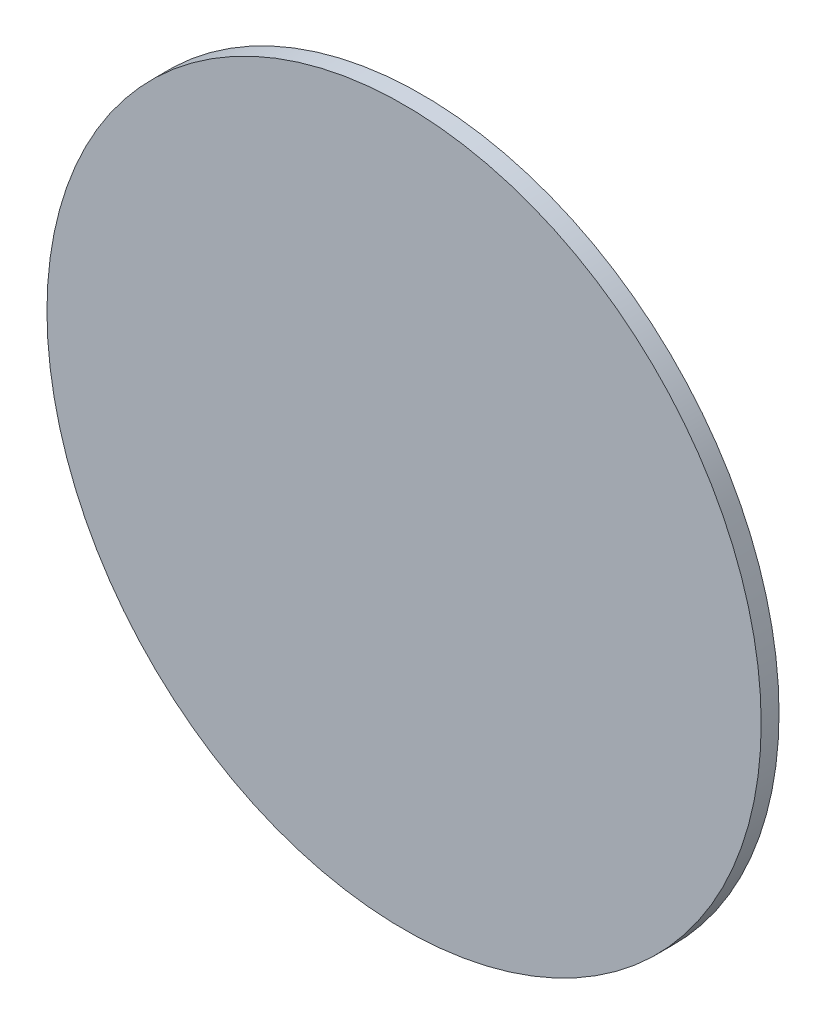
ISO-10303-21;
HEADER;
FILE_DESCRIPTION(('STEP AP214'),'2;1');
FILE_NAME('part.step','',(''),(''),'','','');
FILE_SCHEMA(('AUTOMOTIVE_DESIGN { 1 0 10303 214 1 1 1 1 }'));
ENDSEC;
DATA;
#1=APPLICATION_CONTEXT('core data for automotive mechanical design processes');
#2=APPLICATION_PROTOCOL_DEFINITION('international standard','automotive_design',2000,#1);
#3=PRODUCT_CONTEXT('',#1,'mechanical');
#4=PRODUCT('Part','Part','',(#3));
#5=PRODUCT_RELATED_PRODUCT_CATEGORY('part','',(#4));
#6=PRODUCT_DEFINITION_FORMATION('','',#4);
#7=PRODUCT_DEFINITION_CONTEXT('part definition',#1,'design');
#8=PRODUCT_DEFINITION('design','',#6,#7);
#9=PRODUCT_DEFINITION_SHAPE('','',#8);
#10=(LENGTH_UNIT() NAMED_UNIT(*) SI_UNIT(.MILLI.,.METRE.));
#11=(NAMED_UNIT(*) PLANE_ANGLE_UNIT() SI_UNIT($,.RADIAN.));
#12=(NAMED_UNIT(*) SI_UNIT($,.STERADIAN.) SOLID_ANGLE_UNIT());
#13=UNCERTAINTY_MEASURE_WITH_UNIT(LENGTH_MEASURE(1.E-05),#10,'distance_accuracy_value','');
#14=(GEOMETRIC_REPRESENTATION_CONTEXT(3) GLOBAL_UNCERTAINTY_ASSIGNED_CONTEXT((#13)) GLOBAL_UNIT_ASSIGNED_CONTEXT((#10,
#11,#12)) REPRESENTATION_CONTEXT('',''));
#15=CARTESIAN_POINT('',(0.,0.,0.));
#16=DIRECTION('',(0.,0.,1.));
#17=DIRECTION('',(1.,0.,0.));
#18=AXIS2_PLACEMENT_3D('',#15,#16,#17);
#19=CARTESIAN_POINT('',(0.1999996,0.,0.00999998));
#20=DIRECTION('',(0.,0.,-1.));
#21=DIRECTION('',(0.,-1.,0.));
#22=AXIS2_PLACEMENT_3D('',#19,#20,#21);
#23=PLANE('',#22);
#24=CARTESIAN_POINT('',(0.,0.,0.00999998));
#25=DIRECTION('',(0.,0.,1.));
#26=DIRECTION('',(1.,0.,0.));
#27=AXIS2_PLACEMENT_3D('',#24,#25,#26);
#28=CIRCLE('',#27,0.1999996);
#29=CARTESIAN_POINT('',(0.1999996,0.,0.00999998));
#30=VERTEX_POINT('',#29);
#31=EDGE_CURVE('E11',#30,#30,#28,.T.);
#32=ORIENTED_EDGE('',*,*,#31,.T.);
#33=EDGE_LOOP('',(#32));
#34=FACE_BOUND('',#33,.T.);
#35=ADVANCED_FACE('F17',(#34),#23,.F.);
#36=CARTESIAN_POINT('',(0.1999996,0.,0.));
#37=DIRECTION('',(0.,0.,-1.));
#38=DIRECTION('',(0.,-1.,0.));
#39=AXIS2_PLACEMENT_3D('',#36,#37,#38);
#40=PLANE('',#39);
#41=CARTESIAN_POINT('',(0.,0.,0.));
#42=DIRECTION('',(0.,0.,1.));
#43=DIRECTION('',(1.,0.,0.));
#44=AXIS2_PLACEMENT_3D('',#41,#42,#43);
#45=CIRCLE('',#44,0.1999996);
#46=CARTESIAN_POINT('',(0.1999996,0.,0.));
#47=VERTEX_POINT('',#46);
#48=EDGE_CURVE('E42',#47,#47,#45,.T.);
#49=ORIENTED_EDGE('',*,*,#48,.F.);
#50=EDGE_LOOP('',(#49));
#51=FACE_BOUND('',#50,.T.);
#52=ADVANCED_FACE('F64',(#51),#40,.T.);
#53=CARTESIAN_POINT('',(0.,0.,0.));
#54=DIRECTION('',(0.,0.,-1.));
#55=DIRECTION('',(1.,0.,0.));
#56=AXIS2_PLACEMENT_3D('',#53,#54,#55);
#57=CYLINDRICAL_SURFACE('',#56,0.1999996);
#58=ORIENTED_EDGE('',*,*,#48,.T.);
#59=DIRECTION('',(0.,0.,1.));
#60=VECTOR('',#59,1.);
#61=CARTESIAN_POINT('',(0.1999996,0.,0.));
#62=LINE('',#61,#60);
#63=EDGE_CURVE('E25',#47,#30,#62,.T.);
#64=ORIENTED_EDGE('',*,*,#63,.T.);
#65=ORIENTED_EDGE('',*,*,#31,.F.);
#66=ORIENTED_EDGE('',*,*,#63,.F.);
#67=EDGE_LOOP('',(#58,#64,#65,#66));
#68=FACE_BOUND('',#67,.T.);
#69=ADVANCED_FACE('F40',(#68),#57,.T.);
#70=CLOSED_SHELL('',(#35,#52,#69));
#71=MANIFOLD_SOLID_BREP('B1',#70);
#72=ADVANCED_BREP_SHAPE_REPRESENTATION('',(#18,#71),#14);
#73=SHAPE_DEFINITION_REPRESENTATION(#9,#72);
ENDSEC;
END-ISO-10303-21;
